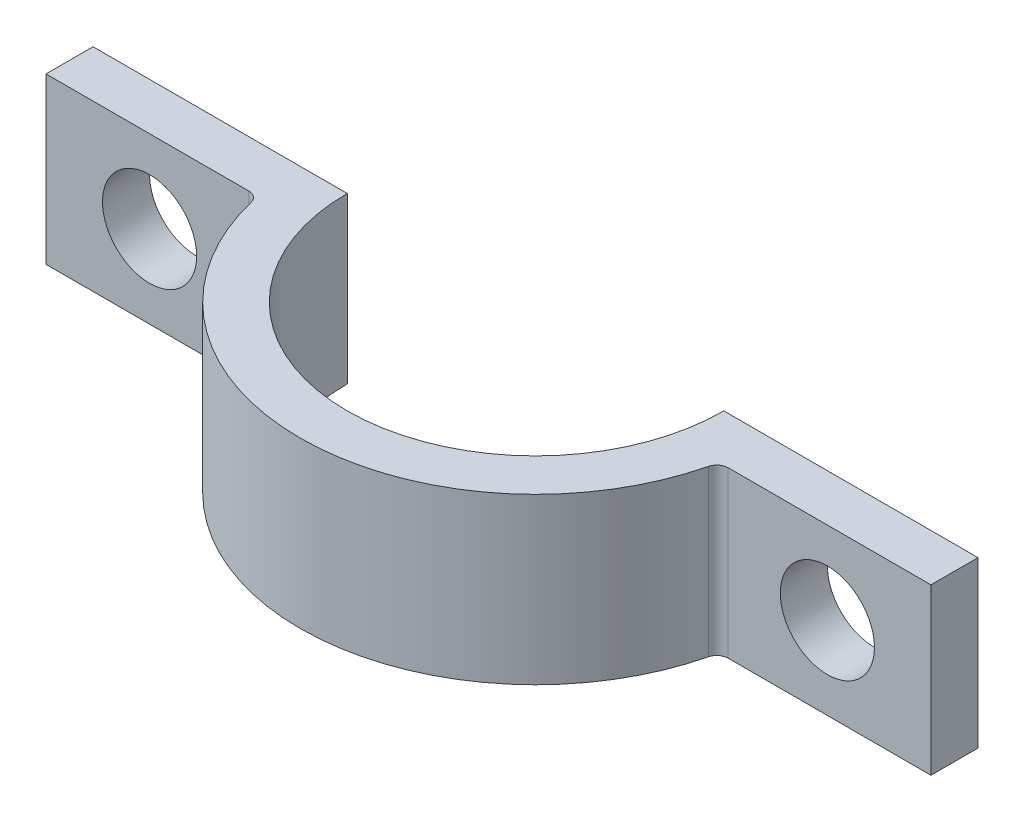
ISO-10303-21;
HEADER;
FILE_DESCRIPTION(('STEP AP214'),'2;1');
FILE_NAME('part.step','',(''),(''),'','','');
FILE_SCHEMA(('AUTOMOTIVE_DESIGN { 1 0 10303 214 1 1 1 1 }'));
ENDSEC;
DATA;
#1=APPLICATION_CONTEXT('core data for automotive mechanical design processes');
#2=APPLICATION_PROTOCOL_DEFINITION('international standard','automotive_design',2000,#1);
#3=PRODUCT_CONTEXT('',#1,'mechanical');
#4=PRODUCT('Part','Part','',(#3));
#5=PRODUCT_RELATED_PRODUCT_CATEGORY('part','',(#4));
#6=PRODUCT_DEFINITION_FORMATION('','',#4);
#7=PRODUCT_DEFINITION_CONTEXT('part definition',#1,'design');
#8=PRODUCT_DEFINITION('design','',#6,#7);
#9=PRODUCT_DEFINITION_SHAPE('','',#8);
#10=(LENGTH_UNIT() NAMED_UNIT(*) SI_UNIT(.MILLI.,.METRE.));
#11=(NAMED_UNIT(*) PLANE_ANGLE_UNIT() SI_UNIT($,.RADIAN.));
#12=(NAMED_UNIT(*) SI_UNIT($,.STERADIAN.) SOLID_ANGLE_UNIT());
#13=UNCERTAINTY_MEASURE_WITH_UNIT(LENGTH_MEASURE(1.E-05),#10,'distance_accuracy_value','');
#14=(GEOMETRIC_REPRESENTATION_CONTEXT(3) GLOBAL_UNCERTAINTY_ASSIGNED_CONTEXT((#13)) GLOBAL_UNIT_ASSIGNED_CONTEXT((#10,
#11,#12)) REPRESENTATION_CONTEXT('',''));
#15=CARTESIAN_POINT('',(0.,0.,0.));
#16=DIRECTION('',(0.,0.,1.));
#17=DIRECTION('',(1.,0.,0.));
#18=AXIS2_PLACEMENT_3D('',#15,#16,#17);
#19=CARTESIAN_POINT('',(0.,5.5626,0.));
#20=DIRECTION('',(0.,-1.,0.));
#21=DIRECTION('',(0.,0.,-1.));
#22=AXIS2_PLACEMENT_3D('',#19,#20,#21);
#23=CYLINDRICAL_SURFACE('',#22,12.7);
#24=CARTESIAN_POINT('',(0.,-5.5626,0.));
#25=DIRECTION('',(0.,-1.,0.));
#26=DIRECTION('',(0.,0.,1.));
#27=AXIS2_PLACEMENT_3D('',#24,#25,#26);
#28=CIRCLE('',#27,12.7);
#29=CARTESIAN_POINT('',(12.7,-5.5626,0.));
#30=VERTEX_POINT('',#29);
#31=CARTESIAN_POINT('',(-12.7,-5.5626,0.));
#32=VERTEX_POINT('',#31);
#33=EDGE_CURVE('E146',#30,#32,#28,.T.);
#34=ORIENTED_EDGE('',*,*,#33,.T.);
#35=DIRECTION('',(0.,-1.,0.));
#36=VECTOR('',#35,1.);
#37=CARTESIAN_POINT('',(-12.7,5.5626,0.));
#38=LINE('',#37,#36);
#39=CARTESIAN_POINT('',(-12.7,5.5626,0.));
#40=VERTEX_POINT('',#39);
#41=EDGE_CURVE('E11',#40,#32,#38,.T.);
#42=ORIENTED_EDGE('',*,*,#41,.F.);
#43=CARTESIAN_POINT('',(0.,5.5626,0.));
#44=DIRECTION('',(0.,-1.,0.));
#45=DIRECTION('',(0.,0.,1.));
#46=AXIS2_PLACEMENT_3D('',#43,#44,#45);
#47=CIRCLE('',#46,12.7);
#48=CARTESIAN_POINT('',(12.7,5.5626,0.));
#49=VERTEX_POINT('',#48);
#50=EDGE_CURVE('E165',#49,#40,#47,.T.);
#51=ORIENTED_EDGE('',*,*,#50,.F.);
#52=DIRECTION('',(0.,-1.,0.));
#53=VECTOR('',#52,1.);
#54=CARTESIAN_POINT('',(12.7,5.5626,0.));
#55=LINE('',#54,#53);
#56=EDGE_CURVE('E142',#49,#30,#55,.T.);
#57=ORIENTED_EDGE('',*,*,#56,.T.);
#58=EDGE_LOOP('',(#34,#42,#51,#57));
#59=FACE_BOUND('',#58,.T.);
#60=ADVANCED_FACE('F38',(#59),#23,.F.);
#61=CARTESIAN_POINT('',(-12.7,5.5626,0.));
#62=DIRECTION('',(0.,0.,1.));
#63=DIRECTION('',(1.,0.,0.));
#64=AXIS2_PLACEMENT_3D('',#61,#62,#63);
#65=PLANE('',#64);
#66=CARTESIAN_POINT('',(-22.86,0.,0.));
#67=DIRECTION('',(0.,0.,1.));
#68=DIRECTION('',(1.,0.,0.));
#69=AXIS2_PLACEMENT_3D('',#66,#67,#68);
#70=CIRCLE('',#69,3.175);
#71=CARTESIAN_POINT('',(-19.685,0.,0.));
#72=VERTEX_POINT('',#71);
#73=EDGE_CURVE('E150',#72,#72,#70,.T.);
#74=ORIENTED_EDGE('',*,*,#73,.T.);
#75=EDGE_LOOP('',(#74));
#76=FACE_BOUND('',#75,.T.);
#77=DIRECTION('',(-1.,0.,0.));
#78=VECTOR('',#77,1.);
#79=CARTESIAN_POINT('',(-12.7,-5.5626,0.));
#80=LINE('',#79,#78);
#81=CARTESIAN_POINT('',(-29.845,-5.5626,0.));
#82=VERTEX_POINT('',#81);
#83=EDGE_CURVE('E149',#32,#82,#80,.T.);
#84=ORIENTED_EDGE('',*,*,#83,.T.);
#85=DIRECTION('',(0.,-1.,0.));
#86=VECTOR('',#85,1.);
#87=CARTESIAN_POINT('',(-29.845,5.5626,0.));
#88=LINE('',#87,#86);
#89=CARTESIAN_POINT('',(-29.845,5.5626,0.));
#90=VERTEX_POINT('',#89);
#91=EDGE_CURVE('E46',#90,#82,#88,.T.);
#92=ORIENTED_EDGE('',*,*,#91,.F.);
#93=DIRECTION('',(-1.,0.,0.));
#94=VECTOR('',#93,1.);
#95=CARTESIAN_POINT('',(-12.7,5.5626,0.));
#96=LINE('',#95,#94);
#97=EDGE_CURVE('E103',#40,#90,#96,.T.);
#98=ORIENTED_EDGE('',*,*,#97,.F.);
#99=ORIENTED_EDGE('',*,*,#41,.T.);
#100=EDGE_LOOP('',(#84,#92,#98,#99));
#101=FACE_BOUND('',#100,.T.);
#102=ADVANCED_FACE('F224',(#76,#101),#65,.F.);
#103=CARTESIAN_POINT('',(-29.845,5.5626,0.));
#104=DIRECTION('',(1.,0.,0.));
#105=DIRECTION('',(0.,0.,-1.));
#106=AXIS2_PLACEMENT_3D('',#103,#104,#105);
#107=PLANE('',#106);
#108=DIRECTION('',(0.,0.,1.));
#109=VECTOR('',#108,1.);
#110=CARTESIAN_POINT('',(-29.845,-5.5626,0.));
#111=LINE('',#110,#109);
#112=CARTESIAN_POINT('',(-29.845,-5.5626,3.175));
#113=VERTEX_POINT('',#112);
#114=EDGE_CURVE('E152',#82,#113,#111,.T.);
#115=ORIENTED_EDGE('',*,*,#114,.T.);
#116=DIRECTION('',(0.,-1.,0.));
#117=VECTOR('',#116,1.);
#118=CARTESIAN_POINT('',(-29.845,5.5626,3.175));
#119=LINE('',#118,#117);
#120=CARTESIAN_POINT('',(-29.845,5.5626,3.175));
#121=VERTEX_POINT('',#120);
#122=EDGE_CURVE('E178',#121,#113,#119,.T.);
#123=ORIENTED_EDGE('',*,*,#122,.F.);
#124=DIRECTION('',(0.,0.,1.));
#125=VECTOR('',#124,1.);
#126=CARTESIAN_POINT('',(-29.845,5.5626,0.));
#127=LINE('',#126,#125);
#128=EDGE_CURVE('E186',#90,#121,#127,.T.);
#129=ORIENTED_EDGE('',*,*,#128,.F.);
#130=ORIENTED_EDGE('',*,*,#91,.T.);
#131=EDGE_LOOP('',(#115,#123,#129,#130));
#132=FACE_BOUND('',#131,.T.);
#133=ADVANCED_FACE('F184',(#132),#107,.F.);
#134=CARTESIAN_POINT('',(-29.845,5.5626,3.175));
#135=DIRECTION('',(0.,0.,-1.));
#136=DIRECTION('',(-1.,0.,0.));
#137=AXIS2_PLACEMENT_3D('',#134,#135,#136);
#138=PLANE('',#137);
#139=CARTESIAN_POINT('',(-22.86,0.,3.17500000000002));
#140=DIRECTION('',(0.,0.,1.));
#141=DIRECTION('',(1.,0.,0.));
#142=AXIS2_PLACEMENT_3D('',#139,#140,#141);
#143=CIRCLE('',#142,3.175);
#144=CARTESIAN_POINT('',(-19.685,0.,3.17500000000002));
#145=VERTEX_POINT('',#144);
#146=EDGE_CURVE('E218',#145,#145,#143,.T.);
#147=ORIENTED_EDGE('',*,*,#146,.F.);
#148=EDGE_LOOP('',(#147));
#149=FACE_BOUND('',#148,.T.);
#150=DIRECTION('',(1.,0.,0.));
#151=VECTOR('',#150,1.);
#152=CARTESIAN_POINT('',(-29.845,-5.5626,3.175));
#153=LINE('',#152,#151);
#154=CARTESIAN_POINT('',(-16.1644610179245,-5.5626,3.17500000000001));
#155=VERTEX_POINT('',#154);
#156=EDGE_CURVE('E154',#113,#155,#153,.T.);
#157=ORIENTED_EDGE('',*,*,#156,.T.);
#158=DIRECTION('',(0.,-1.,0.));
#159=VECTOR('',#158,1.);
#160=CARTESIAN_POINT('',(-16.1644610179245,5.5626,3.17500000000001));
#161=LINE('',#160,#159);
#162=CARTESIAN_POINT('',(-16.1644610179245,5.5626,3.17500000000001));
#163=VERTEX_POINT('',#162);
#164=EDGE_CURVE('E175',#163,#155,#161,.T.);
#165=ORIENTED_EDGE('',*,*,#164,.F.);
#166=DIRECTION('',(1.,0.,0.));
#167=VECTOR('',#166,1.);
#168=CARTESIAN_POINT('',(-29.845,5.5626,3.175));
#169=LINE('',#168,#167);
#170=EDGE_CURVE('E204',#121,#163,#169,.T.);
#171=ORIENTED_EDGE('',*,*,#170,.F.);
#172=ORIENTED_EDGE('',*,*,#122,.T.);
#173=EDGE_LOOP('',(#157,#165,#171,#172));
#174=FACE_BOUND('',#173,.T.);
#175=ADVANCED_FACE('F195',(#149,#174),#138,.F.);
#176=CARTESIAN_POINT('',(-16.1644610179245,5.5626,3.93700000000001));
#177=DIRECTION('',(0.,-1.,0.));
#178=DIRECTION('',(0.,0.,-1.));
#179=AXIS2_PLACEMENT_3D('',#176,#177,#178);
#180=CYLINDRICAL_SURFACE('',#179,0.761999999999999);
#181=CARTESIAN_POINT('',(-16.1644610179245,-5.5626,3.93700000000001));
#182=DIRECTION('',(0.,-1.,0.));
#183=DIRECTION('',(0.,0.,1.));
#184=AXIS2_PLACEMENT_3D('',#181,#182,#183);
#185=CIRCLE('',#184,0.761999999999999);
#186=CARTESIAN_POINT('',(-15.4241040247371,-5.5626,3.75667938931299));
#187=VERTEX_POINT('',#186);
#188=EDGE_CURVE('E156',#155,#187,#185,.T.);
#189=ORIENTED_EDGE('',*,*,#188,.T.);
#190=DIRECTION('',(0.,-1.,0.));
#191=VECTOR('',#190,1.);
#192=CARTESIAN_POINT('',(-15.4241040247371,5.5626,3.75667938931299));
#193=LINE('',#192,#191);
#194=CARTESIAN_POINT('',(-15.4241040247371,5.5626,3.75667938931299));
#195=VERTEX_POINT('',#194);
#196=EDGE_CURVE('E172',#195,#187,#193,.T.);
#197=ORIENTED_EDGE('',*,*,#196,.F.);
#198=CARTESIAN_POINT('',(-16.1644610179245,5.5626,3.93700000000001));
#199=DIRECTION('',(0.,-1.,0.));
#200=DIRECTION('',(0.,0.,1.));
#201=AXIS2_PLACEMENT_3D('',#198,#199,#200);
#202=CIRCLE('',#201,0.761999999999999);
#203=EDGE_CURVE('E201',#163,#195,#202,.T.);
#204=ORIENTED_EDGE('',*,*,#203,.F.);
#205=ORIENTED_EDGE('',*,*,#164,.T.);
#206=EDGE_LOOP('',(#189,#197,#204,#205));
#207=FACE_BOUND('',#206,.T.);
#208=ADVANCED_FACE('F199',(#207),#180,.F.);
#209=CARTESIAN_POINT('',(0.,5.5626,0.));
#210=DIRECTION('',(0.,-1.,0.));
#211=DIRECTION('',(0.,0.,-1.));
#212=AXIS2_PLACEMENT_3D('',#209,#210,#211);
#213=CYLINDRICAL_SURFACE('',#212,15.875);
#214=CARTESIAN_POINT('',(0.,-5.5626,0.));
#215=DIRECTION('',(0.,1.,0.));
#216=DIRECTION('',(0.,0.,1.));
#217=AXIS2_PLACEMENT_3D('',#214,#215,#216);
#218=CIRCLE('',#217,15.875);
#219=CARTESIAN_POINT('',(15.4241040247371,-5.5626,3.75667938931298));
#220=VERTEX_POINT('',#219);
#221=EDGE_CURVE('E158',#187,#220,#218,.T.);
#222=ORIENTED_EDGE('',*,*,#221,.T.);
#223=DIRECTION('',(0.,-1.,0.));
#224=VECTOR('',#223,1.);
#225=CARTESIAN_POINT('',(15.4241040247371,5.5626,3.75667938931298));
#226=LINE('',#225,#224);
#227=CARTESIAN_POINT('',(15.4241040247371,5.5626,3.75667938931298));
#228=VERTEX_POINT('',#227);
#229=EDGE_CURVE('E169',#228,#220,#226,.T.);
#230=ORIENTED_EDGE('',*,*,#229,.F.);
#231=CARTESIAN_POINT('',(0.,5.5626,0.));
#232=DIRECTION('',(0.,1.,0.));
#233=DIRECTION('',(0.,0.,1.));
#234=AXIS2_PLACEMENT_3D('',#231,#232,#233);
#235=CIRCLE('',#234,15.875);
#236=EDGE_CURVE('E203',#195,#228,#235,.T.);
#237=ORIENTED_EDGE('',*,*,#236,.F.);
#238=ORIENTED_EDGE('',*,*,#196,.T.);
#239=EDGE_LOOP('',(#222,#230,#237,#238));
#240=FACE_BOUND('',#239,.T.);
#241=ADVANCED_FACE('F239',(#240),#213,.T.);
#242=CARTESIAN_POINT('',(16.1644610179245,5.5626,3.93700000000001));
#243=DIRECTION('',(0.,-1.,0.));
#244=DIRECTION('',(0.,0.,-1.));
#245=AXIS2_PLACEMENT_3D('',#242,#243,#244);
#246=CYLINDRICAL_SURFACE('',#245,0.761999999999999);
#247=CARTESIAN_POINT('',(16.1644610179245,-5.5626,3.93700000000001));
#248=DIRECTION('',(0.,-1.,0.));
#249=DIRECTION('',(0.,0.,-1.));
#250=AXIS2_PLACEMENT_3D('',#247,#248,#249);
#251=CIRCLE('',#250,0.761999999999999);
#252=CARTESIAN_POINT('',(16.1644610179245,-5.5626,3.17500000000001));
#253=VERTEX_POINT('',#252);
#254=EDGE_CURVE('E160',#220,#253,#251,.T.);
#255=ORIENTED_EDGE('',*,*,#254,.T.);
#256=DIRECTION('',(0.,-1.,0.));
#257=VECTOR('',#256,1.);
#258=CARTESIAN_POINT('',(16.1644610179245,5.5626,3.17500000000001));
#259=LINE('',#258,#257);
#260=CARTESIAN_POINT('',(16.1644610179245,5.5626,3.17500000000001));
#261=VERTEX_POINT('',#260);
#262=EDGE_CURVE('E137',#261,#253,#259,.T.);
#263=ORIENTED_EDGE('',*,*,#262,.F.);
#264=CARTESIAN_POINT('',(16.1644610179245,5.5626,3.93700000000001));
#265=DIRECTION('',(0.,-1.,0.));
#266=DIRECTION('',(0.,0.,-1.));
#267=AXIS2_PLACEMENT_3D('',#264,#265,#266);
#268=CIRCLE('',#267,0.761999999999999);
#269=EDGE_CURVE('E128',#228,#261,#268,.T.);
#270=ORIENTED_EDGE('',*,*,#269,.F.);
#271=ORIENTED_EDGE('',*,*,#229,.T.);
#272=EDGE_LOOP('',(#255,#263,#270,#271));
#273=FACE_BOUND('',#272,.T.);
#274=ADVANCED_FACE('F251',(#273),#246,.F.);
#275=CARTESIAN_POINT('',(29.845,5.5626,3.175));
#276=DIRECTION('',(0.,0.,-1.));
#277=DIRECTION('',(-1.,0.,0.));
#278=AXIS2_PLACEMENT_3D('',#275,#276,#277);
#279=PLANE('',#278);
#280=CARTESIAN_POINT('',(22.86,0.,3.17500000000002));
#281=DIRECTION('',(0.,0.,1.));
#282=DIRECTION('',(1.,0.,0.));
#283=AXIS2_PLACEMENT_3D('',#280,#281,#282);
#284=CIRCLE('',#283,3.175);
#285=CARTESIAN_POINT('',(26.035,0.,3.17500000000002));
#286=VERTEX_POINT('',#285);
#287=EDGE_CURVE('E212',#286,#286,#284,.T.);
#288=ORIENTED_EDGE('',*,*,#287,.F.);
#289=EDGE_LOOP('',(#288));
#290=FACE_BOUND('',#289,.T.);
#291=DIRECTION('',(1.,0.,0.));
#292=VECTOR('',#291,1.);
#293=CARTESIAN_POINT('',(29.845,-5.5626,3.175));
#294=LINE('',#293,#292);
#295=CARTESIAN_POINT('',(29.845,-5.5626,3.175));
#296=VERTEX_POINT('',#295);
#297=EDGE_CURVE('E136',#253,#296,#294,.T.);
#298=ORIENTED_EDGE('',*,*,#297,.T.);
#299=DIRECTION('',(0.,-1.,0.));
#300=VECTOR('',#299,1.);
#301=CARTESIAN_POINT('',(29.845,5.5626,3.175));
#302=LINE('',#301,#300);
#303=CARTESIAN_POINT('',(29.845,5.5626,3.175));
#304=VERTEX_POINT('',#303);
#305=EDGE_CURVE('E133',#304,#296,#302,.T.);
#306=ORIENTED_EDGE('',*,*,#305,.F.);
#307=DIRECTION('',(1.,0.,0.));
#308=VECTOR('',#307,1.);
#309=CARTESIAN_POINT('',(29.845,5.5626,3.175));
#310=LINE('',#309,#308);
#311=EDGE_CURVE('E122',#261,#304,#310,.T.);
#312=ORIENTED_EDGE('',*,*,#311,.F.);
#313=ORIENTED_EDGE('',*,*,#262,.T.);
#314=EDGE_LOOP('',(#298,#306,#312,#313));
#315=FACE_BOUND('',#314,.T.);
#316=ADVANCED_FACE('F134',(#290,#315),#279,.F.);
#317=CARTESIAN_POINT('',(29.845,5.5626,0.));
#318=DIRECTION('',(-1.,0.,0.));
#319=DIRECTION('',(0.,0.,1.));
#320=AXIS2_PLACEMENT_3D('',#317,#318,#319);
#321=PLANE('',#320);
#322=DIRECTION('',(0.,0.,-1.));
#323=VECTOR('',#322,1.);
#324=CARTESIAN_POINT('',(29.845,-5.5626,0.));
#325=LINE('',#324,#323);
#326=CARTESIAN_POINT('',(29.845,-5.5626,0.));
#327=VERTEX_POINT('',#326);
#328=EDGE_CURVE('E89',#296,#327,#325,.T.);
#329=ORIENTED_EDGE('',*,*,#328,.T.);
#330=DIRECTION('',(0.,-1.,0.));
#331=VECTOR('',#330,1.);
#332=CARTESIAN_POINT('',(29.845,5.5626,0.));
#333=LINE('',#332,#331);
#334=CARTESIAN_POINT('',(29.845,5.5626,0.));
#335=VERTEX_POINT('',#334);
#336=EDGE_CURVE('E138',#335,#327,#333,.T.);
#337=ORIENTED_EDGE('',*,*,#336,.F.);
#338=DIRECTION('',(0.,0.,-1.));
#339=VECTOR('',#338,1.);
#340=CARTESIAN_POINT('',(29.845,5.5626,0.));
#341=LINE('',#340,#339);
#342=EDGE_CURVE('E126',#304,#335,#341,.T.);
#343=ORIENTED_EDGE('',*,*,#342,.F.);
#344=ORIENTED_EDGE('',*,*,#305,.T.);
#345=EDGE_LOOP('',(#329,#337,#343,#344));
#346=FACE_BOUND('',#345,.T.);
#347=ADVANCED_FACE('F140',(#346),#321,.F.);
#348=CARTESIAN_POINT('',(12.7,5.5626,0.));
#349=DIRECTION('',(0.,0.,1.));
#350=DIRECTION('',(1.,0.,0.));
#351=AXIS2_PLACEMENT_3D('',#348,#349,#350);
#352=PLANE('',#351);
#353=CARTESIAN_POINT('',(22.86,0.,0.));
#354=DIRECTION('',(0.,0.,1.));
#355=DIRECTION('',(1.,0.,0.));
#356=AXIS2_PLACEMENT_3D('',#353,#354,#355);
#357=CIRCLE('',#356,3.175);
#358=CARTESIAN_POINT('',(26.035,0.,0.));
#359=VERTEX_POINT('',#358);
#360=EDGE_CURVE('E215',#359,#359,#357,.T.);
#361=ORIENTED_EDGE('',*,*,#360,.T.);
#362=EDGE_LOOP('',(#361));
#363=FACE_BOUND('',#362,.T.);
#364=DIRECTION('',(-1.,0.,0.));
#365=VECTOR('',#364,1.);
#366=CARTESIAN_POINT('',(12.7,-5.5626,0.));
#367=LINE('',#366,#365);
#368=EDGE_CURVE('E95',#327,#30,#367,.T.);
#369=ORIENTED_EDGE('',*,*,#368,.T.);
#370=ORIENTED_EDGE('',*,*,#56,.F.);
#371=DIRECTION('',(-1.,0.,0.));
#372=VECTOR('',#371,1.);
#373=CARTESIAN_POINT('',(12.7,5.5626,0.));
#374=LINE('',#373,#372);
#375=EDGE_CURVE('E54',#335,#49,#374,.T.);
#376=ORIENTED_EDGE('',*,*,#375,.F.);
#377=ORIENTED_EDGE('',*,*,#336,.T.);
#378=EDGE_LOOP('',(#369,#370,#376,#377));
#379=FACE_BOUND('',#378,.T.);
#380=ADVANCED_FACE('F266',(#363,#379),#352,.F.);
#381=CARTESIAN_POINT('',(0.,5.5626,0.));
#382=DIRECTION('',(0.,1.,0.));
#383=DIRECTION('',(0.,0.,1.));
#384=AXIS2_PLACEMENT_3D('',#381,#382,#383);
#385=PLANE('',#384);
#386=ORIENTED_EDGE('',*,*,#50,.T.);
#387=ORIENTED_EDGE('',*,*,#97,.T.);
#388=ORIENTED_EDGE('',*,*,#128,.T.);
#389=ORIENTED_EDGE('',*,*,#170,.T.);
#390=ORIENTED_EDGE('',*,*,#203,.T.);
#391=ORIENTED_EDGE('',*,*,#236,.T.);
#392=ORIENTED_EDGE('',*,*,#269,.T.);
#393=ORIENTED_EDGE('',*,*,#311,.T.);
#394=ORIENTED_EDGE('',*,*,#342,.T.);
#395=ORIENTED_EDGE('',*,*,#375,.T.);
#396=EDGE_LOOP('',(#386,#387,#388,#389,#390,#391,#392,#393,#394,#395));
#397=FACE_BOUND('',#396,.T.);
#398=ADVANCED_FACE('F124',(#397),#385,.T.);
#399=CARTESIAN_POINT('',(0.,-5.5626,0.));
#400=DIRECTION('',(0.,1.,0.));
#401=DIRECTION('',(0.,0.,1.));
#402=AXIS2_PLACEMENT_3D('',#399,#400,#401);
#403=PLANE('',#402);
#404=ORIENTED_EDGE('',*,*,#33,.F.);
#405=ORIENTED_EDGE('',*,*,#368,.F.);
#406=ORIENTED_EDGE('',*,*,#328,.F.);
#407=ORIENTED_EDGE('',*,*,#297,.F.);
#408=ORIENTED_EDGE('',*,*,#254,.F.);
#409=ORIENTED_EDGE('',*,*,#221,.F.);
#410=ORIENTED_EDGE('',*,*,#188,.F.);
#411=ORIENTED_EDGE('',*,*,#156,.F.);
#412=ORIENTED_EDGE('',*,*,#114,.F.);
#413=ORIENTED_EDGE('',*,*,#83,.F.);
#414=EDGE_LOOP('',(#404,#405,#406,#407,#408,#409,#410,#411,#412,#413));
#415=FACE_BOUND('',#414,.T.);
#416=ADVANCED_FACE('F190',(#415),#403,.F.);
#417=CARTESIAN_POINT('',(22.86,0.,0.));
#418=DIRECTION('',(0.,0.,1.));
#419=DIRECTION('',(1.,0.,0.));
#420=AXIS2_PLACEMENT_3D('',#417,#418,#419);
#421=CYLINDRICAL_SURFACE('',#420,3.175);
#422=ORIENTED_EDGE('',*,*,#360,.F.);
#423=EDGE_LOOP('',(#422));
#424=FACE_BOUND('',#423,.T.);
#425=ORIENTED_EDGE('',*,*,#287,.T.);
#426=EDGE_LOOP('',(#425));
#427=FACE_BOUND('',#426,.T.);
#428=ADVANCED_FACE('F229',(#424,#427),#421,.F.);
#429=CARTESIAN_POINT('',(-22.86,0.,0.));
#430=DIRECTION('',(0.,0.,1.));
#431=DIRECTION('',(1.,0.,0.));
#432=AXIS2_PLACEMENT_3D('',#429,#430,#431);
#433=CYLINDRICAL_SURFACE('',#432,3.175);
#434=ORIENTED_EDGE('',*,*,#73,.F.);
#435=EDGE_LOOP('',(#434));
#436=FACE_BOUND('',#435,.T.);
#437=ORIENTED_EDGE('',*,*,#146,.T.);
#438=EDGE_LOOP('',(#437));
#439=FACE_BOUND('',#438,.T.);
#440=ADVANCED_FACE('F226',(#436,#439),#433,.F.);
#441=CLOSED_SHELL('',(#60,#102,#133,#175,#208,#241,#274,#316,#347,#380,#398,#416,#428,#440));
#442=MANIFOLD_SOLID_BREP('B2',#441);
#443=ADVANCED_BREP_SHAPE_REPRESENTATION('',(#18,#442),#14);
#444=SHAPE_DEFINITION_REPRESENTATION(#9,#443);
ENDSEC;
END-ISO-10303-21;
